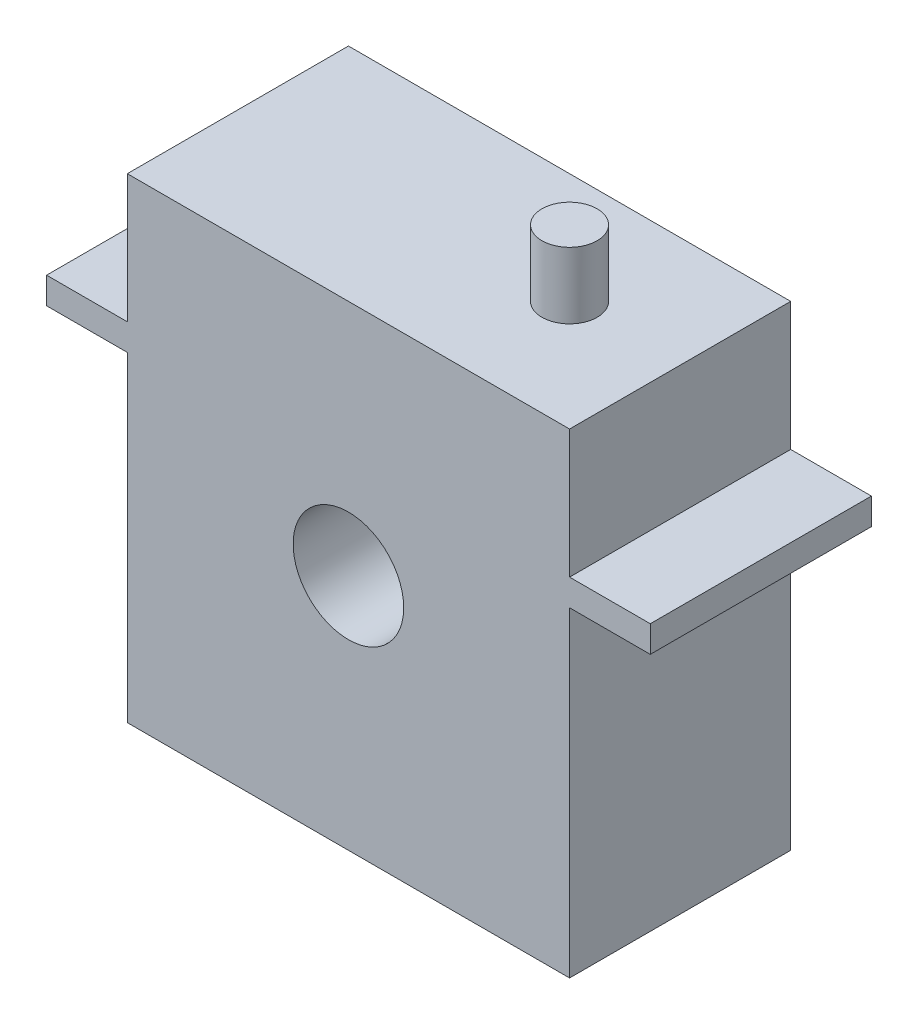
ISO-10303-21;
HEADER;
FILE_DESCRIPTION(('STEP AP214'),'2;1');
FILE_NAME('part.step','',(''),(''),'','','');
FILE_SCHEMA(('AUTOMOTIVE_DESIGN { 1 0 10303 214 1 1 1 1 }'));
ENDSEC;
DATA;
#1=APPLICATION_CONTEXT('core data for automotive mechanical design processes');
#2=APPLICATION_PROTOCOL_DEFINITION('international standard','automotive_design',2000,#1);
#3=PRODUCT_CONTEXT('',#1,'mechanical');
#4=PRODUCT('Part','Part','',(#3));
#5=PRODUCT_RELATED_PRODUCT_CATEGORY('part','',(#4));
#6=PRODUCT_DEFINITION_FORMATION('','',#4);
#7=PRODUCT_DEFINITION_CONTEXT('part definition',#1,'design');
#8=PRODUCT_DEFINITION('design','',#6,#7);
#9=PRODUCT_DEFINITION_SHAPE('','',#8);
#10=(LENGTH_UNIT() NAMED_UNIT(*) SI_UNIT(.MILLI.,.METRE.));
#11=(NAMED_UNIT(*) PLANE_ANGLE_UNIT() SI_UNIT($,.RADIAN.));
#12=(NAMED_UNIT(*) SI_UNIT($,.STERADIAN.) SOLID_ANGLE_UNIT());
#13=UNCERTAINTY_MEASURE_WITH_UNIT(LENGTH_MEASURE(1.E-05),#10,'distance_accuracy_value','');
#14=(GEOMETRIC_REPRESENTATION_CONTEXT(3) GLOBAL_UNCERTAINTY_ASSIGNED_CONTEXT((#13)) GLOBAL_UNIT_ASSIGNED_CONTEXT((#10,
#11,#12)) REPRESENTATION_CONTEXT('',''));
#15=CARTESIAN_POINT('',(0.,0.,0.));
#16=DIRECTION('',(0.,0.,1.));
#17=DIRECTION('',(1.,0.,0.));
#18=AXIS2_PLACEMENT_3D('',#15,#16,#17);
#19=CARTESIAN_POINT('',(20.,-21.5,20.));
#20=DIRECTION('',(-1.,0.,0.));
#21=DIRECTION('',(0.,0.,1.));
#22=AXIS2_PLACEMENT_3D('',#19,#20,#21);
#23=PLANE('',#22);
#24=DIRECTION('',(0.,1.,0.));
#25=VECTOR('',#24,1.);
#26=CARTESIAN_POINT('',(20.,-21.5,20.));
#27=LINE('',#26,#25);
#28=CARTESIAN_POINT('',(20.,9.9,20.));
#29=VERTEX_POINT('',#28);
#30=CARTESIAN_POINT('',(20.,21.5,20.));
#31=VERTEX_POINT('',#30);
#32=EDGE_CURVE('E194',#29,#31,#27,.T.);
#33=ORIENTED_EDGE('',*,*,#32,.F.);
#34=DIRECTION('',(0.,0.,-1.));
#35=VECTOR('',#34,1.);
#36=CARTESIAN_POINT('',(20.,9.9,0.));
#37=LINE('',#36,#35);
#38=CARTESIAN_POINT('',(20.,9.9,0.));
#39=VERTEX_POINT('',#38);
#40=EDGE_CURVE('E140',#29,#39,#37,.T.);
#41=ORIENTED_EDGE('',*,*,#40,.T.);
#42=DIRECTION('',(0.,1.,0.));
#43=VECTOR('',#42,1.);
#44=CARTESIAN_POINT('',(20.,-21.5,0.));
#45=LINE('',#44,#43);
#46=CARTESIAN_POINT('',(20.,21.5,0.));
#47=VERTEX_POINT('',#46);
#48=EDGE_CURVE('E189',#39,#47,#45,.T.);
#49=ORIENTED_EDGE('',*,*,#48,.T.);
#50=DIRECTION('',(0.,0.,-1.));
#51=VECTOR('',#50,1.);
#52=CARTESIAN_POINT('',(20.,21.5,20.));
#53=LINE('',#52,#51);
#54=EDGE_CURVE('E40',#31,#47,#53,.T.);
#55=ORIENTED_EDGE('',*,*,#54,.F.);
#56=EDGE_LOOP('',(#33,#41,#49,#55));
#57=FACE_BOUND('',#56,.T.);
#58=ADVANCED_FACE('F32',(#57),#23,.F.);
#59=CARTESIAN_POINT('',(-20.,-21.5,20.));
#60=DIRECTION('',(1.,0.,0.));
#61=DIRECTION('',(0.,0.,-1.));
#62=AXIS2_PLACEMENT_3D('',#59,#60,#61);
#63=PLANE('',#62);
#64=DIRECTION('',(0.,0.,1.));
#65=VECTOR('',#64,1.);
#66=CARTESIAN_POINT('',(-20.,7.5,0.));
#67=LINE('',#66,#65);
#68=CARTESIAN_POINT('',(-20.,7.5,0.));
#69=VERTEX_POINT('',#68);
#70=CARTESIAN_POINT('',(-20.,7.5,20.));
#71=VERTEX_POINT('',#70);
#72=EDGE_CURVE('E161',#69,#71,#67,.T.);
#73=ORIENTED_EDGE('',*,*,#72,.F.);
#74=DIRECTION('',(0.,-1.,0.));
#75=VECTOR('',#74,1.);
#76=CARTESIAN_POINT('',(-20.,-21.5,0.));
#77=LINE('',#76,#75);
#78=CARTESIAN_POINT('',(-20.,-21.5,0.));
#79=VERTEX_POINT('',#78);
#80=EDGE_CURVE('E207',#69,#79,#77,.T.);
#81=ORIENTED_EDGE('',*,*,#80,.T.);
#82=DIRECTION('',(0.,0.,-1.));
#83=VECTOR('',#82,1.);
#84=CARTESIAN_POINT('',(-20.,-21.5,20.));
#85=LINE('',#84,#83);
#86=CARTESIAN_POINT('',(-20.,-21.5,20.));
#87=VERTEX_POINT('',#86);
#88=EDGE_CURVE('E214',#87,#79,#85,.T.);
#89=ORIENTED_EDGE('',*,*,#88,.F.);
#90=DIRECTION('',(0.,-1.,0.));
#91=VECTOR('',#90,1.);
#92=CARTESIAN_POINT('',(-20.,-21.5,20.));
#93=LINE('',#92,#91);
#94=EDGE_CURVE('E55',#71,#87,#93,.T.);
#95=ORIENTED_EDGE('',*,*,#94,.F.);
#96=EDGE_LOOP('',(#73,#81,#89,#95));
#97=FACE_BOUND('',#96,.T.);
#98=ADVANCED_FACE('F269',(#97),#63,.F.);
#99=DIRECTION('',(0.,0.,-1.));
#100=VECTOR('',#99,1.);
#101=CARTESIAN_POINT('',(-20.,9.9,0.));
#102=LINE('',#101,#100);
#103=CARTESIAN_POINT('',(-20.,9.9,20.));
#104=VERTEX_POINT('',#103);
#105=CARTESIAN_POINT('',(-20.,9.9,0.));
#106=VERTEX_POINT('',#105);
#107=EDGE_CURVE('E129',#104,#106,#102,.T.);
#108=ORIENTED_EDGE('',*,*,#107,.F.);
#109=CARTESIAN_POINT('',(-20.,21.5,20.));
#110=VERTEX_POINT('',#109);
#111=EDGE_CURVE('E196',#110,#104,#93,.T.);
#112=ORIENTED_EDGE('',*,*,#111,.F.);
#113=DIRECTION('',(0.,0.,-1.));
#114=VECTOR('',#113,1.);
#115=CARTESIAN_POINT('',(-20.,21.5,20.));
#116=LINE('',#115,#114);
#117=CARTESIAN_POINT('',(-20.,21.5,0.));
#118=VERTEX_POINT('',#117);
#119=EDGE_CURVE('E217',#110,#118,#116,.T.);
#120=ORIENTED_EDGE('',*,*,#119,.T.);
#121=EDGE_CURVE('E208',#118,#106,#77,.T.);
#122=ORIENTED_EDGE('',*,*,#121,.T.);
#123=EDGE_LOOP('',(#108,#112,#120,#122));
#124=FACE_BOUND('',#123,.T.);
#125=ADVANCED_FACE('F238',(#124),#63,.F.);
#126=CARTESIAN_POINT('',(0.,0.,20.));
#127=DIRECTION('',(0.,0.,-1.));
#128=DIRECTION('',(-1.,0.,0.));
#129=AXIS2_PLACEMENT_3D('',#126,#127,#128);
#130=PLANE('',#129);
#131=CARTESIAN_POINT('',(20.,-21.5,20.));
#132=VERTEX_POINT('',#131);
#133=CARTESIAN_POINT('',(20.,7.5,20.));
#134=VERTEX_POINT('',#133);
#135=EDGE_CURVE('E128',#132,#134,#27,.T.);
#136=ORIENTED_EDGE('',*,*,#135,.T.);
#137=DIRECTION('',(-1.,0.,0.));
#138=VECTOR('',#137,1.);
#139=CARTESIAN_POINT('',(27.3,7.5,20.));
#140=LINE('',#139,#138);
#141=CARTESIAN_POINT('',(27.3,7.5,20.));
#142=VERTEX_POINT('',#141);
#143=EDGE_CURVE('E47',#142,#134,#140,.T.);
#144=ORIENTED_EDGE('',*,*,#143,.F.);
#145=DIRECTION('',(0.,1.,0.));
#146=VECTOR('',#145,1.);
#147=CARTESIAN_POINT('',(27.3,7.5,20.));
#148=LINE('',#147,#146);
#149=CARTESIAN_POINT('',(27.3,9.9,20.));
#150=VERTEX_POINT('',#149);
#151=EDGE_CURVE('E125',#142,#150,#148,.T.);
#152=ORIENTED_EDGE('',*,*,#151,.T.);
#153=DIRECTION('',(-1.,0.,0.));
#154=VECTOR('',#153,1.);
#155=CARTESIAN_POINT('',(27.3,9.9,20.));
#156=LINE('',#155,#154);
#157=EDGE_CURVE('E148',#150,#29,#156,.T.);
#158=ORIENTED_EDGE('',*,*,#157,.T.);
#159=ORIENTED_EDGE('',*,*,#32,.T.);
#160=DIRECTION('',(-1.,0.,0.));
#161=VECTOR('',#160,1.);
#162=CARTESIAN_POINT('',(-20.,21.5,20.));
#163=LINE('',#162,#161);
#164=EDGE_CURVE('E193',#31,#110,#163,.T.);
#165=ORIENTED_EDGE('',*,*,#164,.T.);
#166=ORIENTED_EDGE('',*,*,#111,.T.);
#167=DIRECTION('',(1.,0.,0.));
#168=VECTOR('',#167,1.);
#169=CARTESIAN_POINT('',(-27.3,9.9,20.));
#170=LINE('',#169,#168);
#171=CARTESIAN_POINT('',(-27.3,9.9,20.));
#172=VERTEX_POINT('',#171);
#173=EDGE_CURVE('E179',#172,#104,#170,.T.);
#174=ORIENTED_EDGE('',*,*,#173,.F.);
#175=DIRECTION('',(0.,1.,0.));
#176=VECTOR('',#175,1.);
#177=CARTESIAN_POINT('',(-27.3,7.5,20.));
#178=LINE('',#177,#176);
#179=CARTESIAN_POINT('',(-27.3,7.5,20.));
#180=VERTEX_POINT('',#179);
#181=EDGE_CURVE('E157',#180,#172,#178,.T.);
#182=ORIENTED_EDGE('',*,*,#181,.F.);
#183=DIRECTION('',(1.,0.,0.));
#184=VECTOR('',#183,1.);
#185=CARTESIAN_POINT('',(-27.3,7.5,20.));
#186=LINE('',#185,#184);
#187=EDGE_CURVE('E167',#180,#71,#186,.T.);
#188=ORIENTED_EDGE('',*,*,#187,.T.);
#189=ORIENTED_EDGE('',*,*,#94,.T.);
#190=DIRECTION('',(1.,0.,0.));
#191=VECTOR('',#190,1.);
#192=CARTESIAN_POINT('',(-20.,-21.5,20.));
#193=LINE('',#192,#191);
#194=EDGE_CURVE('E199',#87,#132,#193,.T.);
#195=ORIENTED_EDGE('',*,*,#194,.T.);
#196=EDGE_LOOP('',(#136,#144,#152,#158,#159,#165,#166,#174,#182,#188,#189,#195));
#197=FACE_BOUND('',#196,.T.);
#198=CARTESIAN_POINT('',(0.,0.,20.));
#199=DIRECTION('',(0.,0.,1.));
#200=DIRECTION('',(1.,0.,0.));
#201=AXIS2_PLACEMENT_3D('',#198,#199,#200);
#202=CIRCLE('',#201,5.);
#203=CARTESIAN_POINT('',(5.,0.,20.));
#204=VERTEX_POINT('',#203);
#205=EDGE_CURVE('E186',#204,#204,#202,.T.);
#206=ORIENTED_EDGE('',*,*,#205,.F.);
#207=EDGE_LOOP('',(#206));
#208=FACE_BOUND('',#207,.T.);
#209=ADVANCED_FACE('F123',(#197,#208),#130,.F.);
#210=CARTESIAN_POINT('',(0.,0.,0.));
#211=DIRECTION('',(0.,0.,-1.));
#212=DIRECTION('',(-1.,0.,0.));
#213=AXIS2_PLACEMENT_3D('',#210,#211,#212);
#214=PLANE('',#213);
#215=CARTESIAN_POINT('',(20.,-21.5,0.));
#216=VERTEX_POINT('',#215);
#217=CARTESIAN_POINT('',(20.,7.5,0.));
#218=VERTEX_POINT('',#217);
#219=EDGE_CURVE('E202',#216,#218,#45,.T.);
#220=ORIENTED_EDGE('',*,*,#219,.F.);
#221=DIRECTION('',(1.,0.,0.));
#222=VECTOR('',#221,1.);
#223=CARTESIAN_POINT('',(-20.,-21.5,0.));
#224=LINE('',#223,#222);
#225=EDGE_CURVE('E210',#79,#216,#224,.T.);
#226=ORIENTED_EDGE('',*,*,#225,.F.);
#227=ORIENTED_EDGE('',*,*,#80,.F.);
#228=DIRECTION('',(1.,0.,0.));
#229=VECTOR('',#228,1.);
#230=CARTESIAN_POINT('',(-27.3,7.5,0.));
#231=LINE('',#230,#229);
#232=CARTESIAN_POINT('',(-27.3,7.5,0.));
#233=VERTEX_POINT('',#232);
#234=EDGE_CURVE('E173',#233,#69,#231,.T.);
#235=ORIENTED_EDGE('',*,*,#234,.F.);
#236=DIRECTION('',(0.,-1.,0.));
#237=VECTOR('',#236,1.);
#238=CARTESIAN_POINT('',(-27.3,7.5,0.));
#239=LINE('',#238,#237);
#240=CARTESIAN_POINT('',(-27.3,9.9,0.));
#241=VERTEX_POINT('',#240);
#242=EDGE_CURVE('E163',#241,#233,#239,.T.);
#243=ORIENTED_EDGE('',*,*,#242,.F.);
#244=DIRECTION('',(1.,0.,0.));
#245=VECTOR('',#244,1.);
#246=CARTESIAN_POINT('',(-27.3,9.9,0.));
#247=LINE('',#246,#245);
#248=EDGE_CURVE('E176',#241,#106,#247,.T.);
#249=ORIENTED_EDGE('',*,*,#248,.T.);
#250=ORIENTED_EDGE('',*,*,#121,.F.);
#251=DIRECTION('',(-1.,0.,0.));
#252=VECTOR('',#251,1.);
#253=CARTESIAN_POINT('',(-20.,21.5,0.));
#254=LINE('',#253,#252);
#255=EDGE_CURVE('E205',#47,#118,#254,.T.);
#256=ORIENTED_EDGE('',*,*,#255,.F.);
#257=ORIENTED_EDGE('',*,*,#48,.F.);
#258=DIRECTION('',(-1.,0.,0.));
#259=VECTOR('',#258,1.);
#260=CARTESIAN_POINT('',(27.3,9.9,0.));
#261=LINE('',#260,#259);
#262=CARTESIAN_POINT('',(27.3,9.9,0.));
#263=VERTEX_POINT('',#262);
#264=EDGE_CURVE('E154',#263,#39,#261,.T.);
#265=ORIENTED_EDGE('',*,*,#264,.F.);
#266=DIRECTION('',(0.,-1.,0.));
#267=VECTOR('',#266,1.);
#268=CARTESIAN_POINT('',(27.3,7.5,0.));
#269=LINE('',#268,#267);
#270=CARTESIAN_POINT('',(27.3,7.5,0.));
#271=VERTEX_POINT('',#270);
#272=EDGE_CURVE('E143',#263,#271,#269,.T.);
#273=ORIENTED_EDGE('',*,*,#272,.T.);
#274=DIRECTION('',(-1.,0.,0.));
#275=VECTOR('',#274,1.);
#276=CARTESIAN_POINT('',(27.3,7.5,0.));
#277=LINE('',#276,#275);
#278=EDGE_CURVE('E130',#271,#218,#277,.T.);
#279=ORIENTED_EDGE('',*,*,#278,.T.);
#280=EDGE_LOOP('',(#220,#226,#227,#235,#243,#249,#250,#256,#257,#265,#273,#279));
#281=FACE_BOUND('',#280,.T.);
#282=CARTESIAN_POINT('',(0.,0.,0.));
#283=DIRECTION('',(0.,0.,1.));
#284=DIRECTION('',(1.,0.,0.));
#285=AXIS2_PLACEMENT_3D('',#282,#283,#284);
#286=CIRCLE('',#285,5.);
#287=CARTESIAN_POINT('',(5.,0.,0.));
#288=VERTEX_POINT('',#287);
#289=EDGE_CURVE('E185',#288,#288,#286,.T.);
#290=ORIENTED_EDGE('',*,*,#289,.T.);
#291=EDGE_LOOP('',(#290));
#292=FACE_BOUND('',#291,.T.);
#293=ADVANCED_FACE('F233',(#281,#292),#214,.T.);
#294=ORIENTED_EDGE('',*,*,#219,.T.);
#295=DIRECTION('',(0.,0.,1.));
#296=VECTOR('',#295,1.);
#297=CARTESIAN_POINT('',(20.,7.5,0.));
#298=LINE('',#297,#296);
#299=EDGE_CURVE('E149',#218,#134,#298,.T.);
#300=ORIENTED_EDGE('',*,*,#299,.T.);
#301=ORIENTED_EDGE('',*,*,#135,.F.);
#302=DIRECTION('',(0.,0.,-1.));
#303=VECTOR('',#302,1.);
#304=CARTESIAN_POINT('',(20.,-21.5,20.));
#305=LINE('',#304,#303);
#306=EDGE_CURVE('E201',#132,#216,#305,.T.);
#307=ORIENTED_EDGE('',*,*,#306,.T.);
#308=EDGE_LOOP('',(#294,#300,#301,#307));
#309=FACE_BOUND('',#308,.T.);
#310=ADVANCED_FACE('F34',(#309),#23,.F.);
#311=CARTESIAN_POINT('',(-20.,21.5,20.));
#312=DIRECTION('',(0.,-1.,0.));
#313=DIRECTION('',(0.,0.,-1.));
#314=AXIS2_PLACEMENT_3D('',#311,#312,#313);
#315=PLANE('',#314);
#316=CARTESIAN_POINT('',(10.,21.5,10.));
#317=DIRECTION('',(0.,-1.,0.));
#318=DIRECTION('',(0.,0.,-1.));
#319=AXIS2_PLACEMENT_3D('',#316,#317,#318);
#320=CIRCLE('',#319,2.5);
#321=CARTESIAN_POINT('',(10.,21.5,7.5));
#322=VERTEX_POINT('',#321);
#323=EDGE_CURVE('E11',#322,#322,#320,.F.);
#324=ORIENTED_EDGE('',*,*,#323,.F.);
#325=EDGE_LOOP('',(#324));
#326=FACE_BOUND('',#325,.T.);
#327=ORIENTED_EDGE('',*,*,#255,.T.);
#328=ORIENTED_EDGE('',*,*,#119,.F.);
#329=ORIENTED_EDGE('',*,*,#164,.F.);
#330=ORIENTED_EDGE('',*,*,#54,.T.);
#331=EDGE_LOOP('',(#327,#328,#329,#330));
#332=FACE_BOUND('',#331,.T.);
#333=ADVANCED_FACE('F223',(#326,#332),#315,.F.);
#334=CARTESIAN_POINT('',(-20.,-21.5,20.));
#335=DIRECTION('',(0.,1.,0.));
#336=DIRECTION('',(0.,0.,1.));
#337=AXIS2_PLACEMENT_3D('',#334,#335,#336);
#338=PLANE('',#337);
#339=ORIENTED_EDGE('',*,*,#225,.T.);
#340=ORIENTED_EDGE('',*,*,#306,.F.);
#341=ORIENTED_EDGE('',*,*,#194,.F.);
#342=ORIENTED_EDGE('',*,*,#88,.T.);
#343=EDGE_LOOP('',(#339,#340,#341,#342));
#344=FACE_BOUND('',#343,.T.);
#345=ADVANCED_FACE('F251',(#344),#338,.F.);
#346=CARTESIAN_POINT('',(0.,0.,20.));
#347=DIRECTION('',(0.,0.,-1.));
#348=DIRECTION('',(-1.,0.,0.));
#349=AXIS2_PLACEMENT_3D('',#346,#347,#348);
#350=CYLINDRICAL_SURFACE('',#349,5.);
#351=ORIENTED_EDGE('',*,*,#205,.T.);
#352=EDGE_LOOP('',(#351));
#353=FACE_BOUND('',#352,.T.);
#354=ORIENTED_EDGE('',*,*,#289,.F.);
#355=EDGE_LOOP('',(#354));
#356=FACE_BOUND('',#355,.T.);
#357=ADVANCED_FACE('F288',(#353,#356),#350,.F.);
#358=CARTESIAN_POINT('',(10.,27.5,10.));
#359=DIRECTION('',(0.,-1.,0.));
#360=DIRECTION('',(0.,0.,-1.));
#361=AXIS2_PLACEMENT_3D('',#358,#359,#360);
#362=CYLINDRICAL_SURFACE('',#361,2.5);
#363=CARTESIAN_POINT('',(10.,27.5,10.));
#364=DIRECTION('',(0.,1.,0.));
#365=DIRECTION('',(0.,0.,1.));
#366=AXIS2_PLACEMENT_3D('',#363,#364,#365);
#367=CIRCLE('',#366,2.5);
#368=CARTESIAN_POINT('',(10.,27.5,12.5));
#369=VERTEX_POINT('',#368);
#370=EDGE_CURVE('E182',#369,#369,#367,.T.);
#371=ORIENTED_EDGE('',*,*,#370,.F.);
#372=EDGE_LOOP('',(#371));
#373=FACE_BOUND('',#372,.T.);
#374=ORIENTED_EDGE('',*,*,#323,.T.);
#375=EDGE_LOOP('',(#374));
#376=FACE_BOUND('',#375,.T.);
#377=ADVANCED_FACE('F292',(#373,#376),#362,.T.);
#378=CARTESIAN_POINT('',(10.,27.5,10.));
#379=DIRECTION('',(0.,1.,0.));
#380=DIRECTION('',(0.,0.,1.));
#381=AXIS2_PLACEMENT_3D('',#378,#379,#380);
#382=PLANE('',#381);
#383=ORIENTED_EDGE('',*,*,#370,.T.);
#384=EDGE_LOOP('',(#383));
#385=FACE_BOUND('',#384,.T.);
#386=ADVANCED_FACE('F297',(#385),#382,.T.);
#387=CARTESIAN_POINT('',(-27.3,9.9,0.));
#388=DIRECTION('',(0.,-1.,0.));
#389=DIRECTION('',(0.,0.,-1.));
#390=AXIS2_PLACEMENT_3D('',#387,#388,#389);
#391=PLANE('',#390);
#392=ORIENTED_EDGE('',*,*,#107,.T.);
#393=ORIENTED_EDGE('',*,*,#248,.F.);
#394=DIRECTION('',(0.,0.,-1.));
#395=VECTOR('',#394,1.);
#396=CARTESIAN_POINT('',(-27.3,9.9,0.));
#397=LINE('',#396,#395);
#398=EDGE_CURVE('E160',#172,#241,#397,.T.);
#399=ORIENTED_EDGE('',*,*,#398,.F.);
#400=ORIENTED_EDGE('',*,*,#173,.T.);
#401=EDGE_LOOP('',(#392,#393,#399,#400));
#402=FACE_BOUND('',#401,.T.);
#403=ADVANCED_FACE('F241',(#402),#391,.F.);
#404=CARTESIAN_POINT('',(-27.3,7.5,0.));
#405=DIRECTION('',(0.,1.,0.));
#406=DIRECTION('',(0.,0.,1.));
#407=AXIS2_PLACEMENT_3D('',#404,#405,#406);
#408=PLANE('',#407);
#409=ORIENTED_EDGE('',*,*,#72,.T.);
#410=ORIENTED_EDGE('',*,*,#187,.F.);
#411=DIRECTION('',(0.,0.,1.));
#412=VECTOR('',#411,1.);
#413=CARTESIAN_POINT('',(-27.3,7.5,0.));
#414=LINE('',#413,#412);
#415=EDGE_CURVE('E165',#233,#180,#414,.T.);
#416=ORIENTED_EDGE('',*,*,#415,.F.);
#417=ORIENTED_EDGE('',*,*,#234,.T.);
#418=EDGE_LOOP('',(#409,#410,#416,#417));
#419=FACE_BOUND('',#418,.T.);
#420=ADVANCED_FACE('F256',(#419),#408,.F.);
#421=CARTESIAN_POINT('',(-27.3,0.,0.));
#422=DIRECTION('',(1.,0.,0.));
#423=DIRECTION('',(0.,0.,-1.));
#424=AXIS2_PLACEMENT_3D('',#421,#422,#423);
#425=PLANE('',#424);
#426=ORIENTED_EDGE('',*,*,#181,.T.);
#427=ORIENTED_EDGE('',*,*,#398,.T.);
#428=ORIENTED_EDGE('',*,*,#242,.T.);
#429=ORIENTED_EDGE('',*,*,#415,.T.);
#430=EDGE_LOOP('',(#426,#427,#428,#429));
#431=FACE_BOUND('',#430,.T.);
#432=ADVANCED_FACE('F259',(#431),#425,.F.);
#433=CARTESIAN_POINT('',(27.3,7.5,0.));
#434=DIRECTION('',(0.,-1.,0.));
#435=DIRECTION('',(0.,0.,-1.));
#436=AXIS2_PLACEMENT_3D('',#433,#434,#435);
#437=PLANE('',#436);
#438=ORIENTED_EDGE('',*,*,#299,.F.);
#439=ORIENTED_EDGE('',*,*,#278,.F.);
#440=DIRECTION('',(0.,0.,1.));
#441=VECTOR('',#440,1.);
#442=CARTESIAN_POINT('',(27.3,7.5,0.));
#443=LINE('',#442,#441);
#444=EDGE_CURVE('E136',#271,#142,#443,.T.);
#445=ORIENTED_EDGE('',*,*,#444,.T.);
#446=ORIENTED_EDGE('',*,*,#143,.T.);
#447=EDGE_LOOP('',(#438,#439,#445,#446));
#448=FACE_BOUND('',#447,.T.);
#449=ADVANCED_FACE('F142',(#448),#437,.T.);
#450=CARTESIAN_POINT('',(27.3,9.9,0.));
#451=DIRECTION('',(0.,1.,0.));
#452=DIRECTION('',(0.,0.,1.));
#453=AXIS2_PLACEMENT_3D('',#450,#451,#452);
#454=PLANE('',#453);
#455=ORIENTED_EDGE('',*,*,#40,.F.);
#456=ORIENTED_EDGE('',*,*,#157,.F.);
#457=DIRECTION('',(0.,0.,-1.));
#458=VECTOR('',#457,1.);
#459=CARTESIAN_POINT('',(27.3,9.9,0.));
#460=LINE('',#459,#458);
#461=EDGE_CURVE('E139',#150,#263,#460,.T.);
#462=ORIENTED_EDGE('',*,*,#461,.T.);
#463=ORIENTED_EDGE('',*,*,#264,.T.);
#464=EDGE_LOOP('',(#455,#456,#462,#463));
#465=FACE_BOUND('',#464,.T.);
#466=ADVANCED_FACE('F245',(#465),#454,.T.);
#467=CARTESIAN_POINT('',(27.3,0.,0.));
#468=DIRECTION('',(-1.,0.,0.));
#469=DIRECTION('',(0.,0.,-1.));
#470=AXIS2_PLACEMENT_3D('',#467,#468,#469);
#471=PLANE('',#470);
#472=ORIENTED_EDGE('',*,*,#151,.F.);
#473=ORIENTED_EDGE('',*,*,#444,.F.);
#474=ORIENTED_EDGE('',*,*,#272,.F.);
#475=ORIENTED_EDGE('',*,*,#461,.F.);
#476=EDGE_LOOP('',(#472,#473,#474,#475));
#477=FACE_BOUND('',#476,.T.);
#478=ADVANCED_FACE('F134',(#477),#471,.F.);
#479=CLOSED_SHELL('',(#58,#98,#125,#209,#293,#310,#333,#345,#357,#377,#386,#403,#420,#432,#449,
#466,#478));
#480=MANIFOLD_SOLID_BREP('B2',#479);
#481=ADVANCED_BREP_SHAPE_REPRESENTATION('',(#18,#480),#14);
#482=SHAPE_DEFINITION_REPRESENTATION(#9,#481);
ENDSEC;
END-ISO-10303-21;
